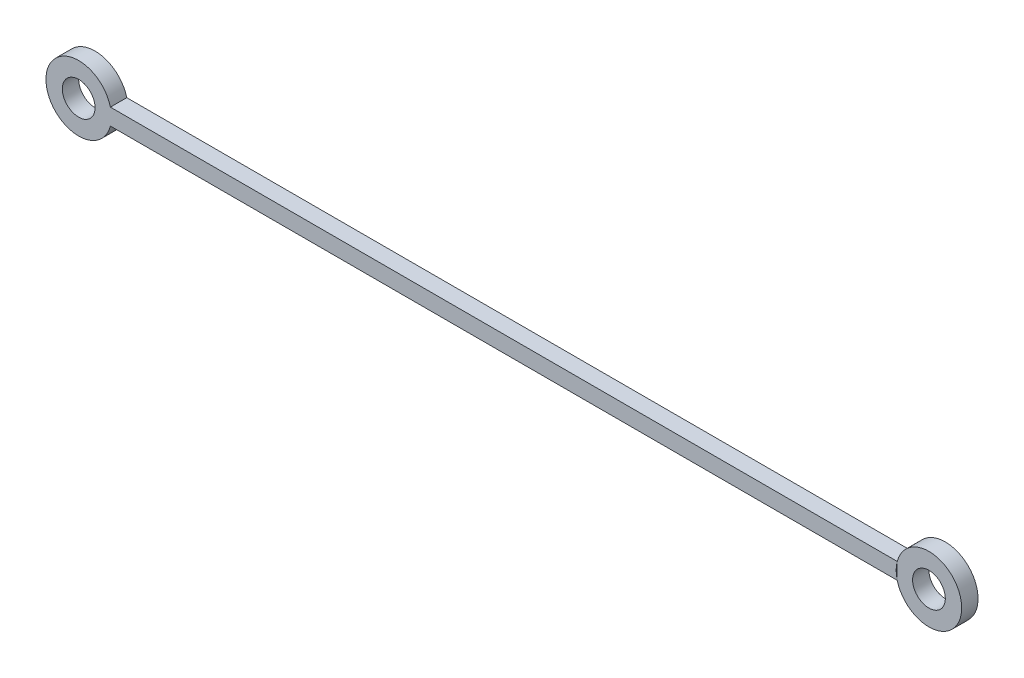
ISO-10303-21;
HEADER;
FILE_DESCRIPTION(('STEP AP214'),'2;1');
FILE_NAME('part.step','',(''),(''),'','','');
FILE_SCHEMA(('AUTOMOTIVE_DESIGN { 1 0 10303 214 1 1 1 1 }'));
ENDSEC;
DATA;
#1=APPLICATION_CONTEXT('core data for automotive mechanical design processes');
#2=APPLICATION_PROTOCOL_DEFINITION('international standard','automotive_design',2000,#1);
#3=PRODUCT_CONTEXT('',#1,'mechanical');
#4=PRODUCT('Part','Part','',(#3));
#5=PRODUCT_RELATED_PRODUCT_CATEGORY('part','',(#4));
#6=PRODUCT_DEFINITION_FORMATION('','',#4);
#7=PRODUCT_DEFINITION_CONTEXT('part definition',#1,'design');
#8=PRODUCT_DEFINITION('design','',#6,#7);
#9=PRODUCT_DEFINITION_SHAPE('','',#8);
#10=(LENGTH_UNIT() NAMED_UNIT(*) SI_UNIT(.MILLI.,.METRE.));
#11=(NAMED_UNIT(*) PLANE_ANGLE_UNIT() SI_UNIT($,.RADIAN.));
#12=(NAMED_UNIT(*) SI_UNIT($,.STERADIAN.) SOLID_ANGLE_UNIT());
#13=UNCERTAINTY_MEASURE_WITH_UNIT(LENGTH_MEASURE(1.E-05),#10,'distance_accuracy_value','');
#14=(GEOMETRIC_REPRESENTATION_CONTEXT(3) GLOBAL_UNCERTAINTY_ASSIGNED_CONTEXT((#13)) GLOBAL_UNIT_ASSIGNED_CONTEXT((#10,
#11,#12)) REPRESENTATION_CONTEXT('',''));
#15=CARTESIAN_POINT('',(0.,0.,0.));
#16=DIRECTION('',(0.,0.,1.));
#17=DIRECTION('',(1.,0.,0.));
#18=AXIS2_PLACEMENT_3D('',#15,#16,#17);
#19=CARTESIAN_POINT('',(-3.87298334620742,0.,2.));
#20=DIRECTION('',(1.,0.,0.));
#21=DIRECTION('',(0.,1.,0.));
#22=AXIS2_PLACEMENT_3D('',#19,#20,#21);
#23=PLANE('',#22);
#24=DIRECTION('',(0.,-1.,0.));
#25=VECTOR('',#24,1.);
#26=CARTESIAN_POINT('',(-3.87298334620742,0.,0.));
#27=LINE('',#26,#25);
#28=CARTESIAN_POINT('',(-3.87298334620742,1.,0.));
#29=VERTEX_POINT('',#28);
#30=CARTESIAN_POINT('',(-3.87298334620742,-1.,0.));
#31=VERTEX_POINT('',#30);
#32=EDGE_CURVE('E98',#29,#31,#27,.T.);
#33=ORIENTED_EDGE('',*,*,#32,.T.);
#34=DIRECTION('',(0.,0.,-1.));
#35=VECTOR('',#34,1.);
#36=CARTESIAN_POINT('',(-3.87298334620742,-1.,2.));
#37=LINE('',#36,#35);
#38=CARTESIAN_POINT('',(-3.87298334620742,-1.,2.));
#39=VERTEX_POINT('',#38);
#40=EDGE_CURVE('E13',#39,#31,#37,.T.);
#41=ORIENTED_EDGE('',*,*,#40,.F.);
#42=DIRECTION('',(0.,-1.,0.));
#43=VECTOR('',#42,1.);
#44=CARTESIAN_POINT('',(-3.87298334620742,0.,2.));
#45=LINE('',#44,#43);
#46=CARTESIAN_POINT('',(-3.87298334620742,1.,2.));
#47=VERTEX_POINT('',#46);
#48=EDGE_CURVE('E101',#47,#39,#45,.T.);
#49=ORIENTED_EDGE('',*,*,#48,.F.);
#50=DIRECTION('',(0.,0.,-1.));
#51=VECTOR('',#50,1.);
#52=CARTESIAN_POINT('',(-3.87298334620742,1.,2.));
#53=LINE('',#52,#51);
#54=EDGE_CURVE('E75',#47,#29,#53,.T.);
#55=ORIENTED_EDGE('',*,*,#54,.T.);
#56=EDGE_LOOP('',(#33,#41,#49,#55));
#57=FACE_BOUND('',#56,.T.);
#58=ADVANCED_FACE('F66',(#57),#23,.F.);
#59=CARTESIAN_POINT('',(0.,0.,2.));
#60=DIRECTION('',(0.,0.,-1.));
#61=DIRECTION('',(-1.,0.,0.));
#62=AXIS2_PLACEMENT_3D('',#59,#60,#61);
#63=CYLINDRICAL_SURFACE('',#62,2.);
#64=CARTESIAN_POINT('',(0.,0.,2.));
#65=DIRECTION('',(0.,0.,1.));
#66=DIRECTION('',(1.,0.,0.));
#67=AXIS2_PLACEMENT_3D('',#64,#65,#66);
#68=CIRCLE('',#67,2.);
#69=CARTESIAN_POINT('',(2.,0.,2.));
#70=VERTEX_POINT('',#69);
#71=EDGE_CURVE('E97',#70,#70,#68,.T.);
#72=ORIENTED_EDGE('',*,*,#71,.T.);
#73=EDGE_LOOP('',(#72));
#74=FACE_BOUND('',#73,.T.);
#75=CARTESIAN_POINT('',(0.,0.,0.));
#76=DIRECTION('',(0.,0.,1.));
#77=DIRECTION('',(1.,0.,0.));
#78=AXIS2_PLACEMENT_3D('',#75,#76,#77);
#79=CIRCLE('',#78,2.);
#80=CARTESIAN_POINT('',(2.,0.,0.));
#81=VERTEX_POINT('',#80);
#82=EDGE_CURVE('E103',#81,#81,#79,.T.);
#83=ORIENTED_EDGE('',*,*,#82,.F.);
#84=EDGE_LOOP('',(#83));
#85=FACE_BOUND('',#84,.T.);
#86=ADVANCED_FACE('F68',(#74,#85),#63,.F.);
#87=CARTESIAN_POINT('',(0.,0.,2.));
#88=DIRECTION('',(0.,0.,-1.));
#89=DIRECTION('',(-1.,0.,0.));
#90=AXIS2_PLACEMENT_3D('',#87,#88,#89);
#91=CYLINDRICAL_SURFACE('',#90,4.);
#92=CARTESIAN_POINT('',(0.,0.,0.));
#93=DIRECTION('',(0.,0.,1.));
#94=DIRECTION('',(1.,0.,0.));
#95=AXIS2_PLACEMENT_3D('',#92,#93,#94);
#96=CIRCLE('',#95,4.);
#97=EDGE_CURVE('E90',#31,#29,#96,.T.);
#98=ORIENTED_EDGE('',*,*,#97,.T.);
#99=ORIENTED_EDGE('',*,*,#54,.F.);
#100=CARTESIAN_POINT('',(0.,0.,2.));
#101=DIRECTION('',(0.,0.,1.));
#102=DIRECTION('',(1.,0.,0.));
#103=AXIS2_PLACEMENT_3D('',#100,#101,#102);
#104=CIRCLE('',#103,4.);
#105=EDGE_CURVE('E82',#39,#47,#104,.T.);
#106=ORIENTED_EDGE('',*,*,#105,.F.);
#107=ORIENTED_EDGE('',*,*,#40,.T.);
#108=EDGE_LOOP('',(#98,#99,#106,#107));
#109=FACE_BOUND('',#108,.T.);
#110=ADVANCED_FACE('F93',(#109),#91,.T.);
#111=CARTESIAN_POINT('',(0.,0.,2.));
#112=DIRECTION('',(0.,0.,1.));
#113=DIRECTION('',(1.,0.,0.));
#114=AXIS2_PLACEMENT_3D('',#111,#112,#113);
#115=PLANE('',#114);
#116=ORIENTED_EDGE('',*,*,#71,.F.);
#117=EDGE_LOOP('',(#116));
#118=FACE_BOUND('',#117,.T.);
#119=ORIENTED_EDGE('',*,*,#48,.T.);
#120=ORIENTED_EDGE('',*,*,#105,.T.);
#121=EDGE_LOOP('',(#119,#120));
#122=FACE_BOUND('',#121,.T.);
#123=ADVANCED_FACE('F115',(#118,#122),#115,.T.);
#124=CARTESIAN_POINT('',(0.,0.,0.));
#125=DIRECTION('',(0.,0.,1.));
#126=DIRECTION('',(1.,0.,0.));
#127=AXIS2_PLACEMENT_3D('',#124,#125,#126);
#128=PLANE('',#127);
#129=ORIENTED_EDGE('',*,*,#82,.T.);
#130=EDGE_LOOP('',(#129));
#131=FACE_BOUND('',#130,.T.);
#132=ORIENTED_EDGE('',*,*,#32,.F.);
#133=ORIENTED_EDGE('',*,*,#97,.F.);
#134=EDGE_LOOP('',(#132,#133));
#135=FACE_BOUND('',#134,.T.);
#136=ADVANCED_FACE('F102',(#131,#135),#128,.F.);
#137=CLOSED_SHELL('',(#58,#86,#110,#123,#136));
#138=MANIFOLD_SOLID_BREP('B2',#137);
#139=CARTESIAN_POINT('',(-103.872983346207,0.,2.));
#140=DIRECTION('',(0.,0.,-1.));
#141=DIRECTION('',(-1.,0.,0.));
#142=AXIS2_PLACEMENT_3D('',#139,#140,#141);
#143=CYLINDRICAL_SURFACE('',#142,4.);
#144=CARTESIAN_POINT('',(-103.872983346207,0.,0.));
#145=DIRECTION('',(0.,0.,1.));
#146=DIRECTION('',(1.,0.,0.));
#147=AXIS2_PLACEMENT_3D('',#144,#145,#146);
#148=CIRCLE('',#147,4.);
#149=CARTESIAN_POINT('',(-100.,0.999999999999988,0.));
#150=VERTEX_POINT('',#149);
#151=CARTESIAN_POINT('',(-100.,-1.00000000000001,0.));
#152=VERTEX_POINT('',#151);
#153=EDGE_CURVE('E224',#150,#152,#148,.T.);
#154=ORIENTED_EDGE('',*,*,#153,.T.);
#155=DIRECTION('',(0.,0.,-1.));
#156=VECTOR('',#155,1.);
#157=CARTESIAN_POINT('',(-100.,-1.00000000000001,2.));
#158=LINE('',#157,#156);
#159=CARTESIAN_POINT('',(-100.,-1.00000000000001,2.));
#160=VERTEX_POINT('',#159);
#161=EDGE_CURVE('E64',#160,#152,#158,.T.);
#162=ORIENTED_EDGE('',*,*,#161,.F.);
#163=CARTESIAN_POINT('',(-103.872983346207,0.,2.));
#164=DIRECTION('',(0.,0.,1.));
#165=DIRECTION('',(1.,0.,0.));
#166=AXIS2_PLACEMENT_3D('',#163,#164,#165);
#167=CIRCLE('',#166,4.);
#168=CARTESIAN_POINT('',(-100.,0.999999999999988,2.));
#169=VERTEX_POINT('',#168);
#170=EDGE_CURVE('E198',#169,#160,#167,.T.);
#171=ORIENTED_EDGE('',*,*,#170,.F.);
#172=DIRECTION('',(0.,0.,-1.));
#173=VECTOR('',#172,1.);
#174=CARTESIAN_POINT('',(-100.,0.999999999999988,2.));
#175=LINE('',#174,#173);
#176=EDGE_CURVE('E217',#169,#150,#175,.T.);
#177=ORIENTED_EDGE('',*,*,#176,.T.);
#178=EDGE_LOOP('',(#154,#162,#171,#177));
#179=FACE_BOUND('',#178,.T.);
#180=ADVANCED_FACE('F158',(#179),#143,.T.);
#181=CARTESIAN_POINT('',(0.,-1.,2.));
#182=DIRECTION('',(0.,-1.,0.));
#183=DIRECTION('',(1.,0.,0.));
#184=AXIS2_PLACEMENT_3D('',#181,#182,#183);
#185=PLANE('',#184);
#186=DIRECTION('',(-1.,0.,0.));
#187=VECTOR('',#186,1.);
#188=CARTESIAN_POINT('',(0.,-1.,0.));
#189=LINE('',#188,#187);
#190=CARTESIAN_POINT('',(-3.87298334620742,-1.,0.));
#191=VERTEX_POINT('',#190);
#192=EDGE_CURVE('E207',#191,#152,#189,.T.);
#193=ORIENTED_EDGE('',*,*,#192,.F.);
#194=DIRECTION('',(0.,0.,-1.));
#195=VECTOR('',#194,1.);
#196=CARTESIAN_POINT('',(-3.87298334620742,-1.,2.));
#197=LINE('',#196,#195);
#198=CARTESIAN_POINT('',(-3.87298334620742,-1.,2.));
#199=VERTEX_POINT('',#198);
#200=EDGE_CURVE('E167',#199,#191,#197,.T.);
#201=ORIENTED_EDGE('',*,*,#200,.F.);
#202=DIRECTION('',(-1.,0.,0.));
#203=VECTOR('',#202,1.);
#204=CARTESIAN_POINT('',(0.,-1.,2.));
#205=LINE('',#204,#203);
#206=EDGE_CURVE('E205',#199,#160,#205,.T.);
#207=ORIENTED_EDGE('',*,*,#206,.T.);
#208=ORIENTED_EDGE('',*,*,#161,.T.);
#209=EDGE_LOOP('',(#193,#201,#207,#208));
#210=FACE_BOUND('',#209,.T.);
#211=ADVANCED_FACE('F204',(#210),#185,.T.);
#212=CARTESIAN_POINT('',(0.,0.,2.));
#213=DIRECTION('',(0.,0.,-1.));
#214=DIRECTION('',(-1.,0.,0.));
#215=AXIS2_PLACEMENT_3D('',#212,#213,#214);
#216=CYLINDRICAL_SURFACE('',#215,4.);
#217=CARTESIAN_POINT('',(0.,0.,0.));
#218=DIRECTION('',(0.,0.,1.));
#219=DIRECTION('',(1.,0.,0.));
#220=AXIS2_PLACEMENT_3D('',#217,#218,#219);
#221=CIRCLE('',#220,4.);
#222=CARTESIAN_POINT('',(-3.87298334620742,1.,0.));
#223=VERTEX_POINT('',#222);
#224=EDGE_CURVE('E228',#223,#191,#221,.T.);
#225=ORIENTED_EDGE('',*,*,#224,.F.);
#226=DIRECTION('',(0.,0.,-1.));
#227=VECTOR('',#226,1.);
#228=CARTESIAN_POINT('',(-3.87298334620742,1.,2.));
#229=LINE('',#228,#227);
#230=CARTESIAN_POINT('',(-3.87298334620742,1.,2.));
#231=VERTEX_POINT('',#230);
#232=EDGE_CURVE('E190',#231,#223,#229,.T.);
#233=ORIENTED_EDGE('',*,*,#232,.F.);
#234=CARTESIAN_POINT('',(0.,0.,2.));
#235=DIRECTION('',(0.,0.,1.));
#236=DIRECTION('',(1.,0.,0.));
#237=AXIS2_PLACEMENT_3D('',#234,#235,#236);
#238=CIRCLE('',#237,4.);
#239=EDGE_CURVE('E213',#231,#199,#238,.T.);
#240=ORIENTED_EDGE('',*,*,#239,.T.);
#241=ORIENTED_EDGE('',*,*,#200,.T.);
#242=EDGE_LOOP('',(#225,#233,#240,#241));
#243=FACE_BOUND('',#242,.T.);
#244=ADVANCED_FACE('F215',(#243),#216,.F.);
#245=CARTESIAN_POINT('',(-103.872983346207,0.,2.));
#246=DIRECTION('',(0.,0.,-1.));
#247=DIRECTION('',(-1.,0.,0.));
#248=AXIS2_PLACEMENT_3D('',#245,#246,#247);
#249=CYLINDRICAL_SURFACE('',#248,2.);
#250=CARTESIAN_POINT('',(-103.872983346207,0.,2.));
#251=DIRECTION('',(0.,0.,1.));
#252=DIRECTION('',(1.,0.,0.));
#253=AXIS2_PLACEMENT_3D('',#250,#251,#252);
#254=CIRCLE('',#253,2.);
#255=CARTESIAN_POINT('',(-101.872983346207,0.,2.));
#256=VERTEX_POINT('',#255);
#257=EDGE_CURVE('E231',#256,#256,#254,.T.);
#258=ORIENTED_EDGE('',*,*,#257,.T.);
#259=EDGE_LOOP('',(#258));
#260=FACE_BOUND('',#259,.T.);
#261=CARTESIAN_POINT('',(-103.872983346207,0.,0.));
#262=DIRECTION('',(0.,0.,1.));
#263=DIRECTION('',(1.,0.,0.));
#264=AXIS2_PLACEMENT_3D('',#261,#262,#263);
#265=CIRCLE('',#264,2.);
#266=CARTESIAN_POINT('',(-101.872983346207,0.,0.));
#267=VERTEX_POINT('',#266);
#268=EDGE_CURVE('E221',#267,#267,#265,.T.);
#269=ORIENTED_EDGE('',*,*,#268,.F.);
#270=EDGE_LOOP('',(#269));
#271=FACE_BOUND('',#270,.T.);
#272=ADVANCED_FACE('F160',(#260,#271),#249,.F.);
#273=CARTESIAN_POINT('',(0.,1.,2.));
#274=DIRECTION('',(0.,-1.,0.));
#275=DIRECTION('',(1.,0.,0.));
#276=AXIS2_PLACEMENT_3D('',#273,#274,#275);
#277=PLANE('',#276);
#278=DIRECTION('',(-1.,0.,0.));
#279=VECTOR('',#278,1.);
#280=CARTESIAN_POINT('',(0.,1.,0.));
#281=LINE('',#280,#279);
#282=EDGE_CURVE('E193',#223,#150,#281,.T.);
#283=ORIENTED_EDGE('',*,*,#282,.T.);
#284=ORIENTED_EDGE('',*,*,#176,.F.);
#285=DIRECTION('',(-1.,0.,0.));
#286=VECTOR('',#285,1.);
#287=CARTESIAN_POINT('',(0.,1.,2.));
#288=LINE('',#287,#286);
#289=EDGE_CURVE('E175',#231,#169,#288,.T.);
#290=ORIENTED_EDGE('',*,*,#289,.F.);
#291=ORIENTED_EDGE('',*,*,#232,.T.);
#292=EDGE_LOOP('',(#283,#284,#290,#291));
#293=FACE_BOUND('',#292,.T.);
#294=ADVANCED_FACE('F243',(#293),#277,.F.);
#295=CARTESIAN_POINT('',(0.,0.,2.));
#296=DIRECTION('',(0.,0.,1.));
#297=DIRECTION('',(1.,0.,0.));
#298=AXIS2_PLACEMENT_3D('',#295,#296,#297);
#299=PLANE('',#298);
#300=ORIENTED_EDGE('',*,*,#257,.F.);
#301=EDGE_LOOP('',(#300));
#302=FACE_BOUND('',#301,.T.);
#303=ORIENTED_EDGE('',*,*,#170,.T.);
#304=ORIENTED_EDGE('',*,*,#206,.F.);
#305=ORIENTED_EDGE('',*,*,#239,.F.);
#306=ORIENTED_EDGE('',*,*,#289,.T.);
#307=EDGE_LOOP('',(#303,#304,#305,#306));
#308=FACE_BOUND('',#307,.T.);
#309=ADVANCED_FACE('F212',(#302,#308),#299,.T.);
#310=CARTESIAN_POINT('',(0.,0.,0.));
#311=DIRECTION('',(0.,0.,1.));
#312=DIRECTION('',(1.,0.,0.));
#313=AXIS2_PLACEMENT_3D('',#310,#311,#312);
#314=PLANE('',#313);
#315=ORIENTED_EDGE('',*,*,#268,.T.);
#316=EDGE_LOOP('',(#315));
#317=FACE_BOUND('',#316,.T.);
#318=ORIENTED_EDGE('',*,*,#153,.F.);
#319=ORIENTED_EDGE('',*,*,#282,.F.);
#320=ORIENTED_EDGE('',*,*,#224,.T.);
#321=ORIENTED_EDGE('',*,*,#192,.T.);
#322=EDGE_LOOP('',(#318,#319,#320,#321));
#323=FACE_BOUND('',#322,.T.);
#324=ADVANCED_FACE('F236',(#317,#323),#314,.F.);
#325=CLOSED_SHELL('',(#180,#211,#244,#272,#294,#309,#324));
#326=MANIFOLD_SOLID_BREP('B7',#325);
#327=ADVANCED_BREP_SHAPE_REPRESENTATION('',(#18,#138,#326),#14);
#328=SHAPE_DEFINITION_REPRESENTATION(#9,#327);
ENDSEC;
END-ISO-10303-21;
